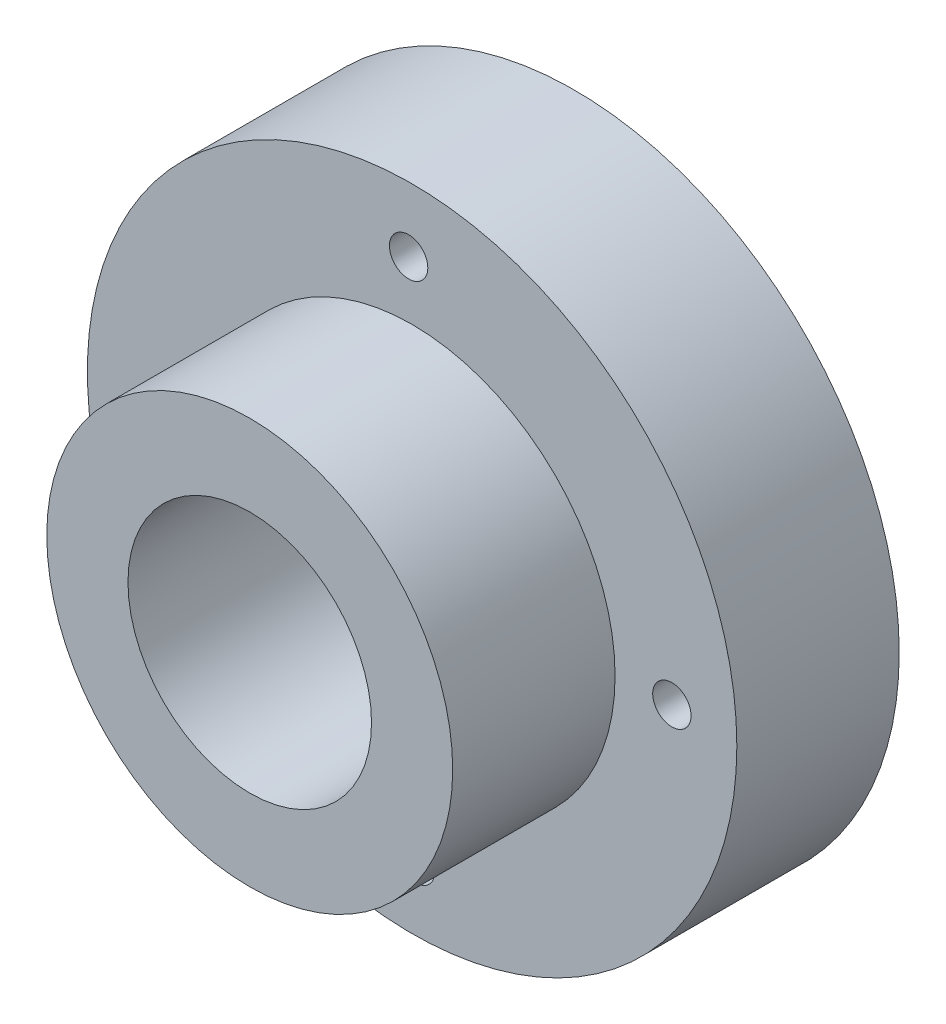
ISO-10303-21;
HEADER;
FILE_DESCRIPTION(('STEP AP214'),'2;1');
FILE_NAME('part.step','',(''),(''),'','','');
FILE_SCHEMA(('AUTOMOTIVE_DESIGN { 1 0 10303 214 1 1 1 1 }'));
ENDSEC;
DATA;
#1=APPLICATION_CONTEXT('core data for automotive mechanical design processes');
#2=APPLICATION_PROTOCOL_DEFINITION('international standard','automotive_design',2000,#1);
#3=PRODUCT_CONTEXT('',#1,'mechanical');
#4=PRODUCT('Part','Part','',(#3));
#5=PRODUCT_RELATED_PRODUCT_CATEGORY('part','',(#4));
#6=PRODUCT_DEFINITION_FORMATION('','',#4);
#7=PRODUCT_DEFINITION_CONTEXT('part definition',#1,'design');
#8=PRODUCT_DEFINITION('design','',#6,#7);
#9=PRODUCT_DEFINITION_SHAPE('','',#8);
#10=(LENGTH_UNIT() NAMED_UNIT(*) SI_UNIT(.MILLI.,.METRE.));
#11=(NAMED_UNIT(*) PLANE_ANGLE_UNIT() SI_UNIT($,.RADIAN.));
#12=(NAMED_UNIT(*) SI_UNIT($,.STERADIAN.) SOLID_ANGLE_UNIT());
#13=UNCERTAINTY_MEASURE_WITH_UNIT(LENGTH_MEASURE(1.E-05),#10,'distance_accuracy_value','');
#14=(GEOMETRIC_REPRESENTATION_CONTEXT(3) GLOBAL_UNCERTAINTY_ASSIGNED_CONTEXT((#13)) GLOBAL_UNIT_ASSIGNED_CONTEXT((#10,
#11,#12)) REPRESENTATION_CONTEXT('',''));
#15=CARTESIAN_POINT('',(0.,0.,0.));
#16=DIRECTION('',(0.,0.,1.));
#17=DIRECTION('',(1.,0.,0.));
#18=AXIS2_PLACEMENT_3D('',#15,#16,#17);
#19=CARTESIAN_POINT('',(0.,0.,25.4));
#20=DIRECTION('',(0.,0.,-1.));
#21=DIRECTION('',(-1.,0.,0.));
#22=AXIS2_PLACEMENT_3D('',#19,#20,#21);
#23=CYLINDRICAL_SURFACE('',#22,25.4);
#24=CARTESIAN_POINT('',(0.,0.,0.));
#25=DIRECTION('',(0.,0.,1.));
#26=DIRECTION('',(1.,0.,0.));
#27=AXIS2_PLACEMENT_3D('',#24,#25,#26);
#28=CIRCLE('',#27,25.4);
#29=CARTESIAN_POINT('',(25.4,0.,0.));
#30=VERTEX_POINT('',#29);
#31=EDGE_CURVE('E12',#30,#30,#28,.T.);
#32=ORIENTED_EDGE('',*,*,#31,.T.);
#33=EDGE_LOOP('',(#32));
#34=FACE_BOUND('',#33,.T.);
#35=CARTESIAN_POINT('',(0.,0.,12.7));
#36=DIRECTION('',(0.,0.,1.));
#37=DIRECTION('',(1.,0.,0.));
#38=AXIS2_PLACEMENT_3D('',#35,#36,#37);
#39=CIRCLE('',#38,25.4);
#40=CARTESIAN_POINT('',(25.4,0.,12.7));
#41=VERTEX_POINT('',#40);
#42=EDGE_CURVE('E50',#41,#41,#39,.T.);
#43=ORIENTED_EDGE('',*,*,#42,.F.);
#44=EDGE_LOOP('',(#43));
#45=FACE_BOUND('',#44,.T.);
#46=ADVANCED_FACE('F44',(#34,#45),#23,.T.);
#47=CARTESIAN_POINT('',(0.,0.,0.));
#48=DIRECTION('',(0.,0.,1.));
#49=DIRECTION('',(1.,0.,0.));
#50=AXIS2_PLACEMENT_3D('',#47,#48,#49);
#51=PLANE('',#50);
#52=CARTESIAN_POINT('',(20.3181758248504,0.27227036281206,0.));
#53=DIRECTION('',(0.,0.,1.));
#54=DIRECTION('',(1.,0.,0.));
#55=AXIS2_PLACEMENT_3D('',#52,#53,#54);
#56=CIRCLE('',#55,1.5);
#57=CARTESIAN_POINT('',(21.8181758248504,0.27227036281206,0.));
#58=VERTEX_POINT('',#57);
#59=EDGE_CURVE('E87',#58,#58,#56,.T.);
#60=ORIENTED_EDGE('',*,*,#59,.T.);
#61=EDGE_LOOP('',(#60));
#62=FACE_BOUND('',#61,.T.);
#63=CARTESIAN_POINT('',(0.272270362812055,-20.3181758248504,0.));
#64=DIRECTION('',(0.,0.,1.));
#65=DIRECTION('',(1.,0.,0.));
#66=AXIS2_PLACEMENT_3D('',#63,#64,#65);
#67=CIRCLE('',#66,1.5);
#68=CARTESIAN_POINT('',(1.77227036281205,-20.3181758248504,0.));
#69=VERTEX_POINT('',#68);
#70=EDGE_CURVE('E81',#69,#69,#67,.T.);
#71=ORIENTED_EDGE('',*,*,#70,.T.);
#72=EDGE_LOOP('',(#71));
#73=FACE_BOUND('',#72,.T.);
#74=CARTESIAN_POINT('',(-20.3181758248504,-0.272270362812046,0.));
#75=DIRECTION('',(0.,0.,1.));
#76=DIRECTION('',(1.,0.,0.));
#77=AXIS2_PLACEMENT_3D('',#74,#75,#76);
#78=CIRCLE('',#77,1.5);
#79=CARTESIAN_POINT('',(-18.8181758248504,-0.272270362812046,0.));
#80=VERTEX_POINT('',#79);
#81=EDGE_CURVE('E75',#80,#80,#78,.T.);
#82=ORIENTED_EDGE('',*,*,#81,.T.);
#83=EDGE_LOOP('',(#82));
#84=FACE_BOUND('',#83,.T.);
#85=CARTESIAN_POINT('',(-0.272270362812066,20.3181758248504,0.));
#86=DIRECTION('',(0.,0.,1.));
#87=DIRECTION('',(1.,0.,0.));
#88=AXIS2_PLACEMENT_3D('',#85,#86,#87);
#89=CIRCLE('',#88,1.5);
#90=CARTESIAN_POINT('',(1.22772963718793,20.3181758248504,0.));
#91=VERTEX_POINT('',#90);
#92=EDGE_CURVE('E69',#91,#91,#89,.T.);
#93=ORIENTED_EDGE('',*,*,#92,.T.);
#94=EDGE_LOOP('',(#93));
#95=FACE_BOUND('',#94,.T.);
#96=CARTESIAN_POINT('',(0.,0.,0.));
#97=DIRECTION('',(0.,0.,1.));
#98=DIRECTION('',(1.,0.,0.));
#99=AXIS2_PLACEMENT_3D('',#96,#97,#98);
#100=CIRCLE('',#99,9.52499999999999);
#101=CARTESIAN_POINT('',(9.52499999999999,0.,0.));
#102=VERTEX_POINT('',#101);
#103=EDGE_CURVE('E62',#102,#102,#100,.T.);
#104=ORIENTED_EDGE('',*,*,#103,.T.);
#105=EDGE_LOOP('',(#104));
#106=FACE_BOUND('',#105,.T.);
#107=ORIENTED_EDGE('',*,*,#31,.F.);
#108=EDGE_LOOP('',(#107));
#109=FACE_BOUND('',#108,.T.);
#110=ADVANCED_FACE('F100',(#62,#73,#84,#95,#106,#109),#51,.F.);
#111=CARTESIAN_POINT('',(0.,0.,12.7));
#112=DIRECTION('',(0.,0.,1.));
#113=DIRECTION('',(1.,0.,0.));
#114=AXIS2_PLACEMENT_3D('',#111,#112,#113);
#115=PLANE('',#114);
#116=CARTESIAN_POINT('',(20.3181758248504,0.27227036281206,12.7));
#117=DIRECTION('',(0.,0.,1.));
#118=DIRECTION('',(1.,0.,0.));
#119=AXIS2_PLACEMENT_3D('',#116,#117,#118);
#120=CIRCLE('',#119,1.5);
#121=CARTESIAN_POINT('',(21.8181758248504,0.27227036281206,12.7));
#122=VERTEX_POINT('',#121);
#123=EDGE_CURVE('E90',#122,#122,#120,.T.);
#124=ORIENTED_EDGE('',*,*,#123,.F.);
#125=EDGE_LOOP('',(#124));
#126=FACE_BOUND('',#125,.T.);
#127=CARTESIAN_POINT('',(0.272270362812055,-20.3181758248504,12.7));
#128=DIRECTION('',(0.,0.,1.));
#129=DIRECTION('',(1.,0.,0.));
#130=AXIS2_PLACEMENT_3D('',#127,#128,#129);
#131=CIRCLE('',#130,1.5);
#132=CARTESIAN_POINT('',(1.77227036281205,-20.3181758248504,12.7));
#133=VERTEX_POINT('',#132);
#134=EDGE_CURVE('E84',#133,#133,#131,.T.);
#135=ORIENTED_EDGE('',*,*,#134,.F.);
#136=EDGE_LOOP('',(#135));
#137=FACE_BOUND('',#136,.T.);
#138=CARTESIAN_POINT('',(-20.3181758248504,-0.272270362812046,12.7));
#139=DIRECTION('',(0.,0.,1.));
#140=DIRECTION('',(1.,0.,0.));
#141=AXIS2_PLACEMENT_3D('',#138,#139,#140);
#142=CIRCLE('',#141,1.5);
#143=CARTESIAN_POINT('',(-18.8181758248504,-0.272270362812046,12.7));
#144=VERTEX_POINT('',#143);
#145=EDGE_CURVE('E78',#144,#144,#142,.T.);
#146=ORIENTED_EDGE('',*,*,#145,.F.);
#147=EDGE_LOOP('',(#146));
#148=FACE_BOUND('',#147,.T.);
#149=CARTESIAN_POINT('',(-0.272270362812066,20.3181758248504,12.7));
#150=DIRECTION('',(0.,0.,1.));
#151=DIRECTION('',(1.,0.,0.));
#152=AXIS2_PLACEMENT_3D('',#149,#150,#151);
#153=CIRCLE('',#152,1.5);
#154=CARTESIAN_POINT('',(1.22772963718793,20.3181758248504,12.7));
#155=VERTEX_POINT('',#154);
#156=EDGE_CURVE('E72',#155,#155,#153,.T.);
#157=ORIENTED_EDGE('',*,*,#156,.F.);
#158=EDGE_LOOP('',(#157));
#159=FACE_BOUND('',#158,.T.);
#160=CARTESIAN_POINT('',(0.,0.,12.7));
#161=DIRECTION('',(0.,0.,1.));
#162=DIRECTION('',(1.,0.,0.));
#163=AXIS2_PLACEMENT_3D('',#160,#161,#162);
#164=CIRCLE('',#163,15.875);
#165=CARTESIAN_POINT('',(15.875,0.,12.7));
#166=VERTEX_POINT('',#165);
#167=EDGE_CURVE('E54',#166,#166,#164,.T.);
#168=ORIENTED_EDGE('',*,*,#167,.F.);
#169=EDGE_LOOP('',(#168));
#170=FACE_BOUND('',#169,.T.);
#171=ORIENTED_EDGE('',*,*,#42,.T.);
#172=EDGE_LOOP('',(#171));
#173=FACE_BOUND('',#172,.T.);
#174=ADVANCED_FACE('F96',(#126,#137,#148,#159,#170,#173),#115,.T.);
#175=CARTESIAN_POINT('',(0.,0.,12.7));
#176=DIRECTION('',(0.,0.,1.));
#177=DIRECTION('',(1.,0.,0.));
#178=AXIS2_PLACEMENT_3D('',#175,#176,#177);
#179=CYLINDRICAL_SURFACE('',#178,15.875);
#180=ORIENTED_EDGE('',*,*,#167,.T.);
#181=EDGE_LOOP('',(#180));
#182=FACE_BOUND('',#181,.T.);
#183=CARTESIAN_POINT('',(0.,0.,25.4));
#184=DIRECTION('',(0.,0.,1.));
#185=DIRECTION('',(1.,0.,0.));
#186=AXIS2_PLACEMENT_3D('',#183,#184,#185);
#187=CIRCLE('',#186,15.875);
#188=CARTESIAN_POINT('',(15.875,0.,25.4));
#189=VERTEX_POINT('',#188);
#190=EDGE_CURVE('E58',#189,#189,#187,.T.);
#191=ORIENTED_EDGE('',*,*,#190,.F.);
#192=EDGE_LOOP('',(#191));
#193=FACE_BOUND('',#192,.T.);
#194=ADVANCED_FACE('F99',(#182,#193),#179,.T.);
#195=CARTESIAN_POINT('',(0.,0.,25.4));
#196=DIRECTION('',(0.,0.,1.));
#197=DIRECTION('',(1.,0.,0.));
#198=AXIS2_PLACEMENT_3D('',#195,#196,#197);
#199=PLANE('',#198);
#200=CARTESIAN_POINT('',(0.,0.,25.4));
#201=DIRECTION('',(0.,0.,1.));
#202=DIRECTION('',(1.,0.,0.));
#203=AXIS2_PLACEMENT_3D('',#200,#201,#202);
#204=CIRCLE('',#203,9.525);
#205=CARTESIAN_POINT('',(9.525,0.,25.4));
#206=VERTEX_POINT('',#205);
#207=EDGE_CURVE('E66',#206,#206,#204,.T.);
#208=ORIENTED_EDGE('',*,*,#207,.F.);
#209=EDGE_LOOP('',(#208));
#210=FACE_BOUND('',#209,.T.);
#211=ORIENTED_EDGE('',*,*,#190,.T.);
#212=EDGE_LOOP('',(#211));
#213=FACE_BOUND('',#212,.T.);
#214=ADVANCED_FACE('F112',(#210,#213),#199,.T.);
#215=CARTESIAN_POINT('',(0.,0.,25.4));
#216=DIRECTION('',(0.,0.,1.));
#217=DIRECTION('',(1.,0.,0.));
#218=AXIS2_PLACEMENT_3D('',#215,#216,#217);
#219=CYLINDRICAL_SURFACE('',#218,9.52499999999999);
#220=ORIENTED_EDGE('',*,*,#103,.F.);
#221=EDGE_LOOP('',(#220));
#222=FACE_BOUND('',#221,.T.);
#223=ORIENTED_EDGE('',*,*,#207,.T.);
#224=EDGE_LOOP('',(#223));
#225=FACE_BOUND('',#224,.T.);
#226=ADVANCED_FACE('F117',(#222,#225),#219,.F.);
#227=CARTESIAN_POINT('',(-0.272270362812066,20.3181758248504,12.7));
#228=DIRECTION('',(0.,0.,1.));
#229=DIRECTION('',(1.,0.,0.));
#230=AXIS2_PLACEMENT_3D('',#227,#228,#229);
#231=CYLINDRICAL_SURFACE('',#230,1.5);
#232=ORIENTED_EDGE('',*,*,#92,.F.);
#233=EDGE_LOOP('',(#232));
#234=FACE_BOUND('',#233,.T.);
#235=ORIENTED_EDGE('',*,*,#156,.T.);
#236=EDGE_LOOP('',(#235));
#237=FACE_BOUND('',#236,.T.);
#238=ADVANCED_FACE('F123',(#234,#237),#231,.F.);
#239=CARTESIAN_POINT('',(-20.3181758248504,-0.272270362812046,12.7));
#240=DIRECTION('',(0.,0.,1.));
#241=DIRECTION('',(1.,0.,0.));
#242=AXIS2_PLACEMENT_3D('',#239,#240,#241);
#243=CYLINDRICAL_SURFACE('',#242,1.5);
#244=ORIENTED_EDGE('',*,*,#81,.F.);
#245=EDGE_LOOP('',(#244));
#246=FACE_BOUND('',#245,.T.);
#247=ORIENTED_EDGE('',*,*,#145,.T.);
#248=EDGE_LOOP('',(#247));
#249=FACE_BOUND('',#248,.T.);
#250=ADVANCED_FACE('F149',(#246,#249),#243,.F.);
#251=CARTESIAN_POINT('',(0.272270362812055,-20.3181758248504,12.7));
#252=DIRECTION('',(0.,0.,1.));
#253=DIRECTION('',(1.,0.,0.));
#254=AXIS2_PLACEMENT_3D('',#251,#252,#253);
#255=CYLINDRICAL_SURFACE('',#254,1.5);
#256=ORIENTED_EDGE('',*,*,#70,.F.);
#257=EDGE_LOOP('',(#256));
#258=FACE_BOUND('',#257,.T.);
#259=ORIENTED_EDGE('',*,*,#134,.T.);
#260=EDGE_LOOP('',(#259));
#261=FACE_BOUND('',#260,.T.);
#262=ADVANCED_FACE('F154',(#258,#261),#255,.F.);
#263=CARTESIAN_POINT('',(20.3181758248504,0.27227036281206,12.7));
#264=DIRECTION('',(0.,0.,1.));
#265=DIRECTION('',(1.,0.,0.));
#266=AXIS2_PLACEMENT_3D('',#263,#264,#265);
#267=CYLINDRICAL_SURFACE('',#266,1.5);
#268=ORIENTED_EDGE('',*,*,#59,.F.);
#269=EDGE_LOOP('',(#268));
#270=FACE_BOUND('',#269,.T.);
#271=ORIENTED_EDGE('',*,*,#123,.T.);
#272=EDGE_LOOP('',(#271));
#273=FACE_BOUND('',#272,.T.);
#274=ADVANCED_FACE('F94',(#270,#273),#267,.F.);
#275=CLOSED_SHELL('',(#46,#110,#174,#194,#214,#226,#238,#250,#262,#274));
#276=MANIFOLD_SOLID_BREP('B2',#275);
#277=ADVANCED_BREP_SHAPE_REPRESENTATION('',(#18,#276),#14);
#278=SHAPE_DEFINITION_REPRESENTATION(#9,#277);
ENDSEC;
END-ISO-10303-21;
